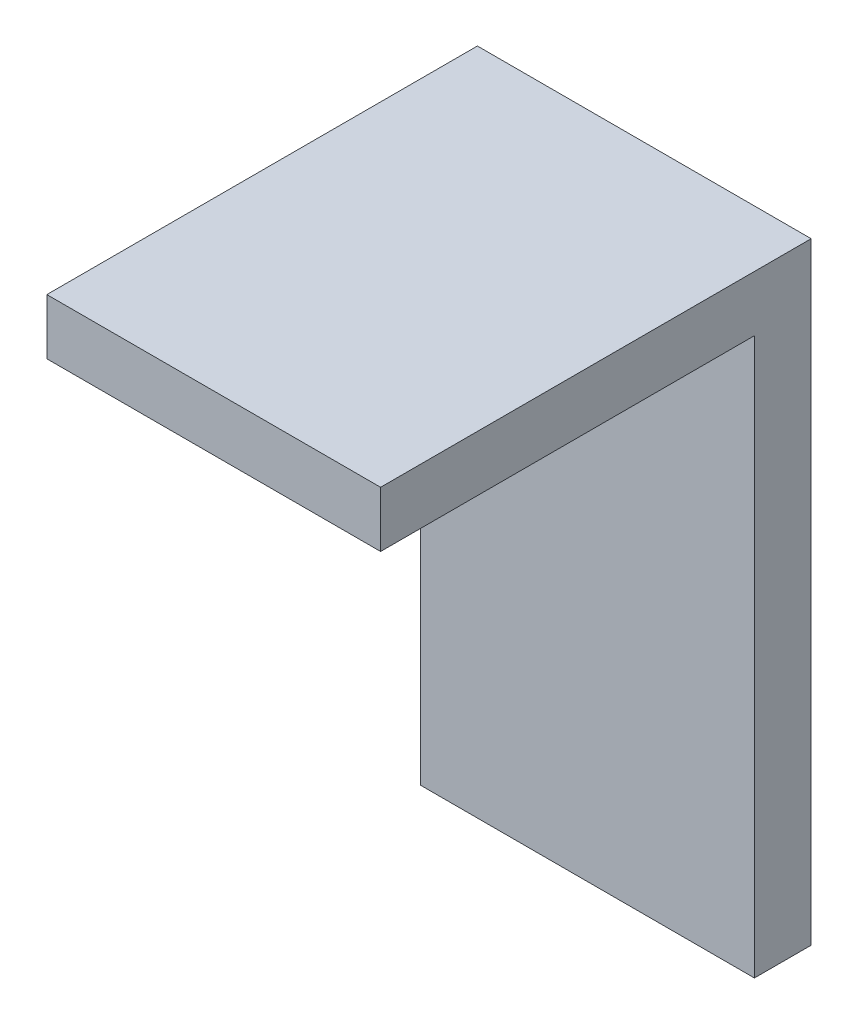
ISO-10303-21;
HEADER;
FILE_DESCRIPTION(('STEP AP214'),'2;1');
FILE_NAME('part.step','',(''),(''),'','','');
FILE_SCHEMA(('AUTOMOTIVE_DESIGN { 1 0 10303 214 1 1 1 1 }'));
ENDSEC;
DATA;
#1=APPLICATION_CONTEXT('core data for automotive mechanical design processes');
#2=APPLICATION_PROTOCOL_DEFINITION('international standard','automotive_design',2000,#1);
#3=PRODUCT_CONTEXT('',#1,'mechanical');
#4=PRODUCT('Part','Part','',(#3));
#5=PRODUCT_RELATED_PRODUCT_CATEGORY('part','',(#4));
#6=PRODUCT_DEFINITION_FORMATION('','',#4);
#7=PRODUCT_DEFINITION_CONTEXT('part definition',#1,'design');
#8=PRODUCT_DEFINITION('design','',#6,#7);
#9=PRODUCT_DEFINITION_SHAPE('','',#8);
#10=(LENGTH_UNIT() NAMED_UNIT(*) SI_UNIT(.MILLI.,.METRE.));
#11=(NAMED_UNIT(*) PLANE_ANGLE_UNIT() SI_UNIT($,.RADIAN.));
#12=(NAMED_UNIT(*) SI_UNIT($,.STERADIAN.) SOLID_ANGLE_UNIT());
#13=UNCERTAINTY_MEASURE_WITH_UNIT(LENGTH_MEASURE(1.E-05),#10,'distance_accuracy_value','');
#14=(GEOMETRIC_REPRESENTATION_CONTEXT(3) GLOBAL_UNCERTAINTY_ASSIGNED_CONTEXT((#13)) GLOBAL_UNIT_ASSIGNED_CONTEXT((#10,
#11,#12)) REPRESENTATION_CONTEXT('',''));
#15=CARTESIAN_POINT('',(0.,0.,0.));
#16=DIRECTION('',(0.,0.,1.));
#17=DIRECTION('',(1.,0.,0.));
#18=AXIS2_PLACEMENT_3D('',#15,#16,#17);
#19=CARTESIAN_POINT('',(-0.9,4.55,0.));
#20=DIRECTION('',(-1.,0.,0.));
#21=DIRECTION('',(0.,0.,1.));
#22=AXIS2_PLACEMENT_3D('',#19,#20,#21);
#23=PLANE('',#22);
#24=DIRECTION('',(0.,1.,0.));
#25=VECTOR('',#24,1.);
#26=CARTESIAN_POINT('',(-0.9,4.,0.));
#27=LINE('',#26,#25);
#28=CARTESIAN_POINT('',(-0.9,4.,0.));
#29=VERTEX_POINT('',#28);
#30=CARTESIAN_POINT('',(-0.9,4.55,0.));
#31=VERTEX_POINT('',#30);
#32=EDGE_CURVE('E11',#29,#31,#27,.T.);
#33=ORIENTED_EDGE('',*,*,#32,.F.);
#34=DIRECTION('',(0.,0.,-1.));
#35=VECTOR('',#34,1.);
#36=CARTESIAN_POINT('',(-0.9,4.,0.051));
#37=LINE('',#36,#35);
#38=CARTESIAN_POINT('',(-0.9,4.,0.051));
#39=VERTEX_POINT('',#38);
#40=EDGE_CURVE('E24',#39,#29,#37,.T.);
#41=ORIENTED_EDGE('',*,*,#40,.F.);
#42=DIRECTION('',(0.,-1.,0.));
#43=VECTOR('',#42,1.);
#44=CARTESIAN_POINT('',(-0.9,4.5,0.051));
#45=LINE('',#44,#43);
#46=CARTESIAN_POINT('',(-0.9,4.5,0.051));
#47=VERTEX_POINT('',#46);
#48=EDGE_CURVE('E87',#47,#39,#45,.T.);
#49=ORIENTED_EDGE('',*,*,#48,.F.);
#50=DIRECTION('',(0.,0.,-1.));
#51=VECTOR('',#50,1.);
#52=CARTESIAN_POINT('',(-0.9,4.5,0.387));
#53=LINE('',#52,#51);
#54=CARTESIAN_POINT('',(-0.9,4.5,0.387));
#55=VERTEX_POINT('',#54);
#56=EDGE_CURVE('E114',#55,#47,#53,.T.);
#57=ORIENTED_EDGE('',*,*,#56,.F.);
#58=DIRECTION('',(0.,-1.,0.));
#59=VECTOR('',#58,1.);
#60=CARTESIAN_POINT('',(-0.9,4.55,0.387));
#61=LINE('',#60,#59);
#62=CARTESIAN_POINT('',(-0.9,4.55,0.387));
#63=VERTEX_POINT('',#62);
#64=EDGE_CURVE('E111',#63,#55,#61,.T.);
#65=ORIENTED_EDGE('',*,*,#64,.F.);
#66=DIRECTION('',(0.,0.,1.));
#67=VECTOR('',#66,1.);
#68=CARTESIAN_POINT('',(-0.9,4.55,0.));
#69=LINE('',#68,#67);
#70=EDGE_CURVE('E108',#31,#63,#69,.T.);
#71=ORIENTED_EDGE('',*,*,#70,.F.);
#72=EDGE_LOOP('',(#33,#41,#49,#57,#65,#71));
#73=FACE_BOUND('',#72,.T.);
#74=ADVANCED_FACE('F17',(#73),#23,.T.);
#75=CARTESIAN_POINT('',(-0.6,4.,0.));
#76=DIRECTION('',(1.,0.,0.));
#77=DIRECTION('',(0.,0.,1.));
#78=AXIS2_PLACEMENT_3D('',#75,#76,#77);
#79=PLANE('',#78);
#80=DIRECTION('',(0.,-1.,0.));
#81=VECTOR('',#80,1.);
#82=CARTESIAN_POINT('',(-0.6,4.55,0.));
#83=LINE('',#82,#81);
#84=CARTESIAN_POINT('',(-0.6,4.55,0.));
#85=VERTEX_POINT('',#84);
#86=CARTESIAN_POINT('',(-0.6,4.,0.));
#87=VERTEX_POINT('',#86);
#88=EDGE_CURVE('E106',#85,#87,#83,.T.);
#89=ORIENTED_EDGE('',*,*,#88,.F.);
#90=DIRECTION('',(0.,0.,-1.));
#91=VECTOR('',#90,1.);
#92=CARTESIAN_POINT('',(-0.6,4.55,0.387));
#93=LINE('',#92,#91);
#94=CARTESIAN_POINT('',(-0.6,4.55,0.387));
#95=VERTEX_POINT('',#94);
#96=EDGE_CURVE('E103',#95,#85,#93,.T.);
#97=ORIENTED_EDGE('',*,*,#96,.F.);
#98=DIRECTION('',(0.,1.,0.));
#99=VECTOR('',#98,1.);
#100=CARTESIAN_POINT('',(-0.6,4.5,0.387));
#101=LINE('',#100,#99);
#102=CARTESIAN_POINT('',(-0.6,4.5,0.387));
#103=VERTEX_POINT('',#102);
#104=EDGE_CURVE('E100',#103,#95,#101,.T.);
#105=ORIENTED_EDGE('',*,*,#104,.F.);
#106=DIRECTION('',(0.,0.,1.));
#107=VECTOR('',#106,1.);
#108=CARTESIAN_POINT('',(-0.6,4.5,0.051));
#109=LINE('',#108,#107);
#110=CARTESIAN_POINT('',(-0.6,4.5,0.051));
#111=VERTEX_POINT('',#110);
#112=EDGE_CURVE('E72',#111,#103,#109,.T.);
#113=ORIENTED_EDGE('',*,*,#112,.F.);
#114=DIRECTION('',(0.,1.,0.));
#115=VECTOR('',#114,1.);
#116=CARTESIAN_POINT('',(-0.6,4.,0.051));
#117=LINE('',#116,#115);
#118=CARTESIAN_POINT('',(-0.6,4.,0.051));
#119=VERTEX_POINT('',#118);
#120=EDGE_CURVE('E66',#119,#111,#117,.T.);
#121=ORIENTED_EDGE('',*,*,#120,.F.);
#122=DIRECTION('',(0.,0.,1.));
#123=VECTOR('',#122,1.);
#124=CARTESIAN_POINT('',(-0.6,4.,0.));
#125=LINE('',#124,#123);
#126=EDGE_CURVE('E69',#87,#119,#125,.T.);
#127=ORIENTED_EDGE('',*,*,#126,.F.);
#128=EDGE_LOOP('',(#89,#97,#105,#113,#121,#127));
#129=FACE_BOUND('',#128,.T.);
#130=ADVANCED_FACE('F68',(#129),#79,.T.);
#131=CARTESIAN_POINT('',(-0.9,4.55,0.387));
#132=DIRECTION('',(0.,0.,1.));
#133=DIRECTION('',(0.,1.,0.));
#134=AXIS2_PLACEMENT_3D('',#131,#132,#133);
#135=PLANE('',#134);
#136=ORIENTED_EDGE('',*,*,#64,.T.);
#137=DIRECTION('',(-1.,0.,0.));
#138=VECTOR('',#137,1.);
#139=CARTESIAN_POINT('',(-0.6,4.5,0.387));
#140=LINE('',#139,#138);
#141=EDGE_CURVE('E83',#103,#55,#140,.T.);
#142=ORIENTED_EDGE('',*,*,#141,.F.);
#143=ORIENTED_EDGE('',*,*,#104,.T.);
#144=DIRECTION('',(1.,0.,0.));
#145=VECTOR('',#144,1.);
#146=CARTESIAN_POINT('',(-0.9,4.55,0.387));
#147=LINE('',#146,#145);
#148=EDGE_CURVE('E88',#63,#95,#147,.T.);
#149=ORIENTED_EDGE('',*,*,#148,.F.);
#150=EDGE_LOOP('',(#136,#142,#143,#149));
#151=FACE_BOUND('',#150,.T.);
#152=ADVANCED_FACE('F125',(#151),#135,.T.);
#153=CARTESIAN_POINT('',(-0.9,4.5,0.051));
#154=DIRECTION('',(0.,0.,1.));
#155=DIRECTION('',(0.,1.,0.));
#156=AXIS2_PLACEMENT_3D('',#153,#154,#155);
#157=PLANE('',#156);
#158=ORIENTED_EDGE('',*,*,#48,.T.);
#159=DIRECTION('',(-1.,0.,0.));
#160=VECTOR('',#159,1.);
#161=CARTESIAN_POINT('',(-0.6,4.,0.051));
#162=LINE('',#161,#160);
#163=EDGE_CURVE('E81',#119,#39,#162,.T.);
#164=ORIENTED_EDGE('',*,*,#163,.F.);
#165=ORIENTED_EDGE('',*,*,#120,.T.);
#166=DIRECTION('',(1.,0.,0.));
#167=VECTOR('',#166,1.);
#168=CARTESIAN_POINT('',(-0.9,4.5,0.051));
#169=LINE('',#168,#167);
#170=EDGE_CURVE('E89',#47,#111,#169,.T.);
#171=ORIENTED_EDGE('',*,*,#170,.F.);
#172=EDGE_LOOP('',(#158,#164,#165,#171));
#173=FACE_BOUND('',#172,.T.);
#174=ADVANCED_FACE('F86',(#173),#157,.T.);
#175=CARTESIAN_POINT('',(-0.6,4.55,0.));
#176=DIRECTION('',(0.,1.,0.));
#177=DIRECTION('',(0.,0.,1.));
#178=AXIS2_PLACEMENT_3D('',#175,#176,#177);
#179=PLANE('',#178);
#180=DIRECTION('',(1.,0.,0.));
#181=VECTOR('',#180,1.);
#182=CARTESIAN_POINT('',(-0.9,4.55,0.));
#183=LINE('',#182,#181);
#184=EDGE_CURVE('E93',#31,#85,#183,.T.);
#185=ORIENTED_EDGE('',*,*,#184,.F.);
#186=ORIENTED_EDGE('',*,*,#70,.T.);
#187=ORIENTED_EDGE('',*,*,#148,.T.);
#188=ORIENTED_EDGE('',*,*,#96,.T.);
#189=EDGE_LOOP('',(#185,#186,#187,#188));
#190=FACE_BOUND('',#189,.T.);
#191=ADVANCED_FACE('F121',(#190),#179,.T.);
#192=CARTESIAN_POINT('',(-0.9,4.,0.));
#193=DIRECTION('',(0.,-1.,0.));
#194=DIRECTION('',(0.,0.,1.));
#195=AXIS2_PLACEMENT_3D('',#192,#193,#194);
#196=PLANE('',#195);
#197=DIRECTION('',(-1.,0.,0.));
#198=VECTOR('',#197,1.);
#199=CARTESIAN_POINT('',(-0.6,4.,0.));
#200=LINE('',#199,#198);
#201=EDGE_CURVE('E82',#87,#29,#200,.T.);
#202=ORIENTED_EDGE('',*,*,#201,.F.);
#203=ORIENTED_EDGE('',*,*,#126,.T.);
#204=ORIENTED_EDGE('',*,*,#163,.T.);
#205=ORIENTED_EDGE('',*,*,#40,.T.);
#206=EDGE_LOOP('',(#202,#203,#204,#205));
#207=FACE_BOUND('',#206,.T.);
#208=ADVANCED_FACE('F80',(#207),#196,.T.);
#209=CARTESIAN_POINT('',(-0.9,4.5,0.051));
#210=DIRECTION('',(0.,-1.,0.));
#211=DIRECTION('',(0.,0.,1.));
#212=AXIS2_PLACEMENT_3D('',#209,#210,#211);
#213=PLANE('',#212);
#214=ORIENTED_EDGE('',*,*,#170,.T.);
#215=ORIENTED_EDGE('',*,*,#112,.T.);
#216=ORIENTED_EDGE('',*,*,#141,.T.);
#217=ORIENTED_EDGE('',*,*,#56,.T.);
#218=EDGE_LOOP('',(#214,#215,#216,#217));
#219=FACE_BOUND('',#218,.T.);
#220=ADVANCED_FACE('F127',(#219),#213,.T.);
#221=CARTESIAN_POINT('',(-0.6,4.55,0.));
#222=DIRECTION('',(0.,0.,-1.));
#223=DIRECTION('',(0.,1.,0.));
#224=AXIS2_PLACEMENT_3D('',#221,#222,#223);
#225=PLANE('',#224);
#226=ORIENTED_EDGE('',*,*,#88,.T.);
#227=ORIENTED_EDGE('',*,*,#201,.T.);
#228=ORIENTED_EDGE('',*,*,#32,.T.);
#229=ORIENTED_EDGE('',*,*,#184,.T.);
#230=EDGE_LOOP('',(#226,#227,#228,#229));
#231=FACE_BOUND('',#230,.T.);
#232=ADVANCED_FACE('F117',(#231),#225,.T.);
#233=CLOSED_SHELL('',(#74,#130,#152,#174,#191,#208,#220,#232));
#234=MANIFOLD_SOLID_BREP('B1',#233);
#235=ADVANCED_BREP_SHAPE_REPRESENTATION('',(#18,#234),#14);
#236=SHAPE_DEFINITION_REPRESENTATION(#9,#235);
ENDSEC;
END-ISO-10303-21;
